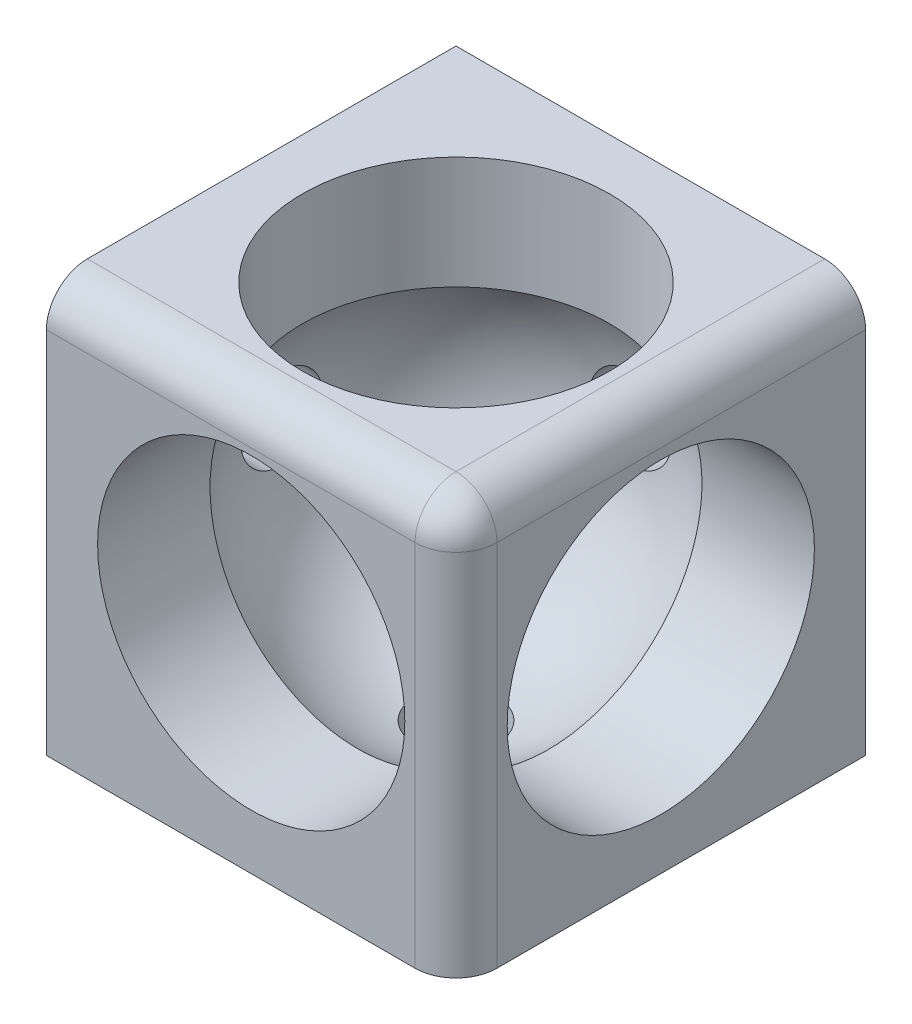
ISO-10303-21;
HEADER;
FILE_DESCRIPTION(('STEP AP214'),'2;1');
FILE_NAME('part.step','',(''),(''),'','','');
FILE_SCHEMA(('AUTOMOTIVE_DESIGN { 1 0 10303 214 1 1 1 1 }'));
ENDSEC;
DATA;
#1=APPLICATION_CONTEXT('core data for automotive mechanical design processes');
#2=APPLICATION_PROTOCOL_DEFINITION('international standard','automotive_design',2000,#1);
#3=PRODUCT_CONTEXT('',#1,'mechanical');
#4=PRODUCT('Part','Part','',(#3));
#5=PRODUCT_RELATED_PRODUCT_CATEGORY('part','',(#4));
#6=PRODUCT_DEFINITION_FORMATION('','',#4);
#7=PRODUCT_DEFINITION_CONTEXT('part definition',#1,'design');
#8=PRODUCT_DEFINITION('design','',#6,#7);
#9=PRODUCT_DEFINITION_SHAPE('','',#8);
#10=(LENGTH_UNIT() NAMED_UNIT(*) SI_UNIT(.MILLI.,.METRE.));
#11=(NAMED_UNIT(*) PLANE_ANGLE_UNIT() SI_UNIT($,.RADIAN.));
#12=(NAMED_UNIT(*) SI_UNIT($,.STERADIAN.) SOLID_ANGLE_UNIT());
#13=UNCERTAINTY_MEASURE_WITH_UNIT(LENGTH_MEASURE(1.E-05),#10,'distance_accuracy_value','');
#14=(GEOMETRIC_REPRESENTATION_CONTEXT(3) GLOBAL_UNCERTAINTY_ASSIGNED_CONTEXT((#13)) GLOBAL_UNIT_ASSIGNED_CONTEXT((#10,
#11,#12)) REPRESENTATION_CONTEXT('',''));
#15=CARTESIAN_POINT('',(0.,0.,0.));
#16=DIRECTION('',(0.,0.,1.));
#17=DIRECTION('',(1.,0.,0.));
#18=AXIS2_PLACEMENT_3D('',#15,#16,#17);
#19=CARTESIAN_POINT('',(-20.,20.,20.));
#20=DIRECTION('',(1.,0.,0.));
#21=DIRECTION('',(0.,0.,-1.));
#22=AXIS2_PLACEMENT_3D('',#19,#20,#21);
#23=PLANE('',#22);
#24=CARTESIAN_POINT('',(-20.,0.,0.));
#25=DIRECTION('',(-1.,0.,0.));
#26=DIRECTION('',(0.,0.,1.));
#27=AXIS2_PLACEMENT_3D('',#24,#25,#26);
#28=CIRCLE('',#27,4.);
#29=CARTESIAN_POINT('',(-20.,0.,4.));
#30=VERTEX_POINT('',#29);
#31=EDGE_CURVE('E388',#30,#30,#28,.T.);
#32=ORIENTED_EDGE('',*,*,#31,.F.);
#33=EDGE_LOOP('',(#32));
#34=FACE_BOUND('',#33,.T.);
#35=DIRECTION('',(0.,-1.,0.));
#36=VECTOR('',#35,1.);
#37=CARTESIAN_POINT('',(-20.,20.,20.));
#38=LINE('',#37,#36);
#39=CARTESIAN_POINT('',(-20.,16.,20.));
#40=VERTEX_POINT('',#39);
#41=CARTESIAN_POINT('',(-20.,-20.,20.));
#42=VERTEX_POINT('',#41);
#43=EDGE_CURVE('E233',#40,#42,#38,.T.);
#44=ORIENTED_EDGE('',*,*,#43,.F.);
#45=CARTESIAN_POINT('',(-20.,16.,16.));
#46=DIRECTION('',(1.,0.,0.));
#47=DIRECTION('',(0.,0.,-1.));
#48=AXIS2_PLACEMENT_3D('',#45,#46,#47);
#49=CIRCLE('',#48,4.);
#50=CARTESIAN_POINT('',(-20.,20.,16.));
#51=VERTEX_POINT('',#50);
#52=EDGE_CURVE('E243',#40,#51,#49,.F.);
#53=ORIENTED_EDGE('',*,*,#52,.T.);
#54=DIRECTION('',(0.,0.,1.));
#55=VECTOR('',#54,1.);
#56=CARTESIAN_POINT('',(-20.,20.,20.));
#57=LINE('',#56,#55);
#58=CARTESIAN_POINT('',(-20.,20.,-20.));
#59=VERTEX_POINT('',#58);
#60=EDGE_CURVE('E228',#59,#51,#57,.T.);
#61=ORIENTED_EDGE('',*,*,#60,.F.);
#62=DIRECTION('',(0.,-1.,0.));
#63=VECTOR('',#62,1.);
#64=CARTESIAN_POINT('',(-20.,20.,-20.));
#65=LINE('',#64,#63);
#66=CARTESIAN_POINT('',(-20.,-20.,-20.));
#67=VERTEX_POINT('',#66);
#68=EDGE_CURVE('E229',#59,#67,#65,.T.);
#69=ORIENTED_EDGE('',*,*,#68,.T.);
#70=DIRECTION('',(0.,0.,1.));
#71=VECTOR('',#70,1.);
#72=CARTESIAN_POINT('',(-20.,-20.,20.));
#73=LINE('',#72,#71);
#74=EDGE_CURVE('E208',#67,#42,#73,.T.);
#75=ORIENTED_EDGE('',*,*,#74,.T.);
#76=EDGE_LOOP('',(#44,#53,#61,#69,#75));
#77=FACE_BOUND('',#76,.T.);
#78=ADVANCED_FACE('F34',(#34,#77),#23,.F.);
#79=CARTESIAN_POINT('',(20.,20.,20.));
#80=DIRECTION('',(0.,0.,-1.));
#81=DIRECTION('',(-1.,0.,0.));
#82=AXIS2_PLACEMENT_3D('',#79,#80,#81);
#83=PLANE('',#82);
#84=CARTESIAN_POINT('',(0.,0.367598837078294,20.));
#85=DIRECTION('',(0.,0.,1.));
#86=DIRECTION('',(1.,0.,0.));
#87=AXIS2_PLACEMENT_3D('',#84,#85,#86);
#88=CIRCLE('',#87,15.);
#89=CARTESIAN_POINT('',(15.,0.367598837078294,20.));
#90=VERTEX_POINT('',#89);
#91=EDGE_CURVE('E108',#90,#90,#88,.T.);
#92=ORIENTED_EDGE('',*,*,#91,.F.);
#93=EDGE_LOOP('',(#92));
#94=FACE_BOUND('',#93,.T.);
#95=DIRECTION('',(0.,-1.,0.));
#96=VECTOR('',#95,1.);
#97=CARTESIAN_POINT('',(16.,20.,20.));
#98=LINE('',#97,#96);
#99=CARTESIAN_POINT('',(16.,-20.,20.));
#100=VERTEX_POINT('',#99);
#101=CARTESIAN_POINT('',(16.,16.,20.));
#102=VERTEX_POINT('',#101);
#103=EDGE_CURVE('E192',#100,#102,#98,.F.);
#104=ORIENTED_EDGE('',*,*,#103,.T.);
#105=DIRECTION('',(1.,0.,0.));
#106=VECTOR('',#105,1.);
#107=CARTESIAN_POINT('',(-20.,16.,20.));
#108=LINE('',#107,#106);
#109=EDGE_CURVE('E241',#102,#40,#108,.F.);
#110=ORIENTED_EDGE('',*,*,#109,.T.);
#111=ORIENTED_EDGE('',*,*,#43,.T.);
#112=DIRECTION('',(1.,0.,0.));
#113=VECTOR('',#112,1.);
#114=CARTESIAN_POINT('',(20.,-20.,20.));
#115=LINE('',#114,#113);
#116=EDGE_CURVE('E212',#42,#100,#115,.T.);
#117=ORIENTED_EDGE('',*,*,#116,.T.);
#118=EDGE_LOOP('',(#104,#110,#111,#117));
#119=FACE_BOUND('',#118,.T.);
#120=ADVANCED_FACE('F164',(#94,#119),#83,.F.);
#121=CARTESIAN_POINT('',(20.,20.,20.));
#122=DIRECTION('',(-1.,0.,0.));
#123=DIRECTION('',(0.,0.,1.));
#124=AXIS2_PLACEMENT_3D('',#121,#122,#123);
#125=PLANE('',#124);
#126=CARTESIAN_POINT('',(20.,0.,0.));
#127=DIRECTION('',(1.,0.,0.));
#128=DIRECTION('',(0.,0.,-1.));
#129=AXIS2_PLACEMENT_3D('',#126,#127,#128);
#130=CIRCLE('',#129,15.);
#131=CARTESIAN_POINT('',(20.,0.,-15.));
#132=VERTEX_POINT('',#131);
#133=EDGE_CURVE('E261',#132,#132,#130,.T.);
#134=ORIENTED_EDGE('',*,*,#133,.F.);
#135=EDGE_LOOP('',(#134));
#136=FACE_BOUND('',#135,.T.);
#137=DIRECTION('',(0.,0.,-1.));
#138=VECTOR('',#137,1.);
#139=CARTESIAN_POINT('',(20.,16.,20.));
#140=LINE('',#139,#138);
#141=CARTESIAN_POINT('',(20.,16.,-20.));
#142=VERTEX_POINT('',#141);
#143=CARTESIAN_POINT('',(20.,16.,16.));
#144=VERTEX_POINT('',#143);
#145=EDGE_CURVE('E198',#142,#144,#140,.F.);
#146=ORIENTED_EDGE('',*,*,#145,.T.);
#147=DIRECTION('',(0.,-1.,0.));
#148=VECTOR('',#147,1.);
#149=CARTESIAN_POINT('',(20.,20.,16.));
#150=LINE('',#149,#148);
#151=CARTESIAN_POINT('',(20.,-20.,16.));
#152=VERTEX_POINT('',#151);
#153=EDGE_CURVE('E190',#144,#152,#150,.T.);
#154=ORIENTED_EDGE('',*,*,#153,.T.);
#155=DIRECTION('',(0.,0.,-1.));
#156=VECTOR('',#155,1.);
#157=CARTESIAN_POINT('',(20.,-20.,20.));
#158=LINE('',#157,#156);
#159=CARTESIAN_POINT('',(20.,-20.,-20.));
#160=VERTEX_POINT('',#159);
#161=EDGE_CURVE('E218',#152,#160,#158,.T.);
#162=ORIENTED_EDGE('',*,*,#161,.T.);
#163=DIRECTION('',(0.,-1.,0.));
#164=VECTOR('',#163,1.);
#165=CARTESIAN_POINT('',(20.,20.,-20.));
#166=LINE('',#165,#164);
#167=EDGE_CURVE('E231',#142,#160,#166,.T.);
#168=ORIENTED_EDGE('',*,*,#167,.F.);
#169=EDGE_LOOP('',(#146,#154,#162,#168));
#170=FACE_BOUND('',#169,.T.);
#171=ADVANCED_FACE('F160',(#136,#170),#125,.F.);
#172=CARTESIAN_POINT('',(20.,20.,-20.));
#173=DIRECTION('',(0.,0.,1.));
#174=DIRECTION('',(1.,0.,0.));
#175=AXIS2_PLACEMENT_3D('',#172,#173,#174);
#176=PLANE('',#175);
#177=CARTESIAN_POINT('',(0.,0.,-20.));
#178=DIRECTION('',(0.,0.,-1.));
#179=DIRECTION('',(-1.,0.,0.));
#180=AXIS2_PLACEMENT_3D('',#177,#178,#179);
#181=CIRCLE('',#180,4.);
#182=CARTESIAN_POINT('',(-4.,0.,-20.));
#183=VERTEX_POINT('',#182);
#184=EDGE_CURVE('E396',#183,#183,#181,.T.);
#185=ORIENTED_EDGE('',*,*,#184,.F.);
#186=EDGE_LOOP('',(#185));
#187=FACE_BOUND('',#186,.T.);
#188=DIRECTION('',(-1.,0.,0.));
#189=VECTOR('',#188,1.);
#190=CARTESIAN_POINT('',(20.,20.,-20.));
#191=LINE('',#190,#189);
#192=CARTESIAN_POINT('',(16.,20.,-20.));
#193=VERTEX_POINT('',#192);
#194=EDGE_CURVE('E221',#193,#59,#191,.T.);
#195=ORIENTED_EDGE('',*,*,#194,.F.);
#196=CARTESIAN_POINT('',(16.,16.,-20.));
#197=DIRECTION('',(0.,0.,1.));
#198=DIRECTION('',(1.,0.,0.));
#199=AXIS2_PLACEMENT_3D('',#196,#197,#198);
#200=CIRCLE('',#199,4.);
#201=EDGE_CURVE('E112',#193,#142,#200,.F.);
#202=ORIENTED_EDGE('',*,*,#201,.T.);
#203=ORIENTED_EDGE('',*,*,#167,.T.);
#204=DIRECTION('',(-1.,0.,0.));
#205=VECTOR('',#204,1.);
#206=CARTESIAN_POINT('',(20.,-20.,-20.));
#207=LINE('',#206,#205);
#208=EDGE_CURVE('E226',#160,#67,#207,.T.);
#209=ORIENTED_EDGE('',*,*,#208,.T.);
#210=ORIENTED_EDGE('',*,*,#68,.F.);
#211=EDGE_LOOP('',(#195,#202,#203,#209,#210));
#212=FACE_BOUND('',#211,.T.);
#213=ADVANCED_FACE('F153',(#187,#212),#176,.F.);
#214=CARTESIAN_POINT('',(0.,20.,0.));
#215=DIRECTION('',(0.,1.,0.));
#216=DIRECTION('',(0.,0.,1.));
#217=AXIS2_PLACEMENT_3D('',#214,#215,#216);
#218=PLANE('',#217);
#219=CARTESIAN_POINT('',(0.,20.,0.));
#220=DIRECTION('',(0.,1.,0.));
#221=DIRECTION('',(0.,0.,1.));
#222=AXIS2_PLACEMENT_3D('',#219,#220,#221);
#223=CIRCLE('',#222,15.);
#224=CARTESIAN_POINT('',(0.,20.,15.));
#225=VERTEX_POINT('',#224);
#226=EDGE_CURVE('E258',#225,#225,#223,.T.);
#227=ORIENTED_EDGE('',*,*,#226,.F.);
#228=EDGE_LOOP('',(#227));
#229=FACE_BOUND('',#228,.T.);
#230=ORIENTED_EDGE('',*,*,#60,.T.);
#231=DIRECTION('',(1.,0.,0.));
#232=VECTOR('',#231,1.);
#233=CARTESIAN_POINT('',(20.,20.,16.));
#234=LINE('',#233,#232);
#235=CARTESIAN_POINT('',(16.,20.,16.));
#236=VERTEX_POINT('',#235);
#237=EDGE_CURVE('E237',#51,#236,#234,.T.);
#238=ORIENTED_EDGE('',*,*,#237,.T.);
#239=DIRECTION('',(0.,0.,-1.));
#240=VECTOR('',#239,1.);
#241=CARTESIAN_POINT('',(16.,20.,-20.));
#242=LINE('',#241,#240);
#243=EDGE_CURVE('E235',#236,#193,#242,.T.);
#244=ORIENTED_EDGE('',*,*,#243,.T.);
#245=ORIENTED_EDGE('',*,*,#194,.T.);
#246=EDGE_LOOP('',(#230,#238,#244,#245));
#247=FACE_BOUND('',#246,.T.);
#248=ADVANCED_FACE('F149',(#229,#247),#218,.T.);
#249=CARTESIAN_POINT('',(0.,-20.,0.));
#250=DIRECTION('',(0.,1.,0.));
#251=DIRECTION('',(0.,0.,1.));
#252=AXIS2_PLACEMENT_3D('',#249,#250,#251);
#253=PLANE('',#252);
#254=CARTESIAN_POINT('',(0.,-20.,0.));
#255=DIRECTION('',(0.,-1.,0.));
#256=DIRECTION('',(0.,0.,-1.));
#257=AXIS2_PLACEMENT_3D('',#254,#255,#256);
#258=CIRCLE('',#257,4.);
#259=CARTESIAN_POINT('',(0.,-20.,-4.));
#260=VERTEX_POINT('',#259);
#261=EDGE_CURVE('E391',#260,#260,#258,.T.);
#262=ORIENTED_EDGE('',*,*,#261,.F.);
#263=EDGE_LOOP('',(#262));
#264=FACE_BOUND('',#263,.T.);
#265=ORIENTED_EDGE('',*,*,#161,.F.);
#266=CARTESIAN_POINT('',(16.,-20.,16.));
#267=DIRECTION('',(0.,1.,0.));
#268=DIRECTION('',(0.,0.,1.));
#269=AXIS2_PLACEMENT_3D('',#266,#267,#268);
#270=CIRCLE('',#269,4.);
#271=EDGE_CURVE('E114',#152,#100,#270,.F.);
#272=ORIENTED_EDGE('',*,*,#271,.T.);
#273=ORIENTED_EDGE('',*,*,#116,.F.);
#274=ORIENTED_EDGE('',*,*,#74,.F.);
#275=ORIENTED_EDGE('',*,*,#208,.F.);
#276=EDGE_LOOP('',(#265,#272,#273,#274,#275));
#277=FACE_BOUND('',#276,.T.);
#278=ADVANCED_FACE('F152',(#264,#277),#253,.F.);
#279=CARTESIAN_POINT('',(16.,16.,0.));
#280=DIRECTION('',(0.,0.,1.));
#281=DIRECTION('',(1.,0.,0.));
#282=AXIS2_PLACEMENT_3D('',#279,#280,#281);
#283=CYLINDRICAL_SURFACE('',#282,4.);
#284=ORIENTED_EDGE('',*,*,#201,.F.);
#285=ORIENTED_EDGE('',*,*,#243,.F.);
#286=CARTESIAN_POINT('',(16.,16.,16.));
#287=DIRECTION('',(0.,0.,1.));
#288=DIRECTION('',(1.,0.,0.));
#289=AXIS2_PLACEMENT_3D('',#286,#287,#288);
#290=CIRCLE('',#289,4.);
#291=EDGE_CURVE('E206',#144,#236,#290,.T.);
#292=ORIENTED_EDGE('',*,*,#291,.F.);
#293=ORIENTED_EDGE('',*,*,#145,.F.);
#294=EDGE_LOOP('',(#284,#285,#292,#293));
#295=FACE_BOUND('',#294,.T.);
#296=ADVANCED_FACE('F36',(#295),#283,.T.);
#297=CARTESIAN_POINT('',(16.,20.,16.));
#298=DIRECTION('',(0.,-1.,0.));
#299=DIRECTION('',(0.,0.,-1.));
#300=AXIS2_PLACEMENT_3D('',#297,#298,#299);
#301=CYLINDRICAL_SURFACE('',#300,4.);
#302=ORIENTED_EDGE('',*,*,#271,.F.);
#303=ORIENTED_EDGE('',*,*,#153,.F.);
#304=CARTESIAN_POINT('',(16.,16.,16.));
#305=DIRECTION('',(0.,1.,0.));
#306=DIRECTION('',(0.,0.,1.));
#307=AXIS2_PLACEMENT_3D('',#304,#305,#306);
#308=CIRCLE('',#307,4.);
#309=EDGE_CURVE('E204',#102,#144,#308,.T.);
#310=ORIENTED_EDGE('',*,*,#309,.F.);
#311=ORIENTED_EDGE('',*,*,#103,.F.);
#312=EDGE_LOOP('',(#302,#303,#310,#311));
#313=FACE_BOUND('',#312,.T.);
#314=ADVANCED_FACE('F178',(#313),#301,.T.);
#315=CARTESIAN_POINT('',(16.,16.,16.));
#316=DIRECTION('',(1.,0.,0.));
#317=DIRECTION('',(0.,0.,-1.));
#318=AXIS2_PLACEMENT_3D('',#315,#316,#317);
#319=SPHERICAL_SURFACE('',#318,4.);
#320=ORIENTED_EDGE('',*,*,#309,.T.);
#321=ORIENTED_EDGE('',*,*,#291,.T.);
#322=CARTESIAN_POINT('',(16.,16.,16.));
#323=DIRECTION('',(1.,0.,0.));
#324=DIRECTION('',(0.,0.,-1.));
#325=AXIS2_PLACEMENT_3D('',#322,#323,#324);
#326=CIRCLE('',#325,4.);
#327=EDGE_CURVE('E202',#102,#236,#326,.F.);
#328=ORIENTED_EDGE('',*,*,#327,.F.);
#329=EDGE_LOOP('',(#320,#321,#328));
#330=FACE_BOUND('',#329,.T.);
#331=ADVANCED_FACE('F175',(#330),#319,.T.);
#332=CARTESIAN_POINT('',(0.,16.,16.));
#333=DIRECTION('',(-1.,0.,0.));
#334=DIRECTION('',(0.,0.,1.));
#335=AXIS2_PLACEMENT_3D('',#332,#333,#334);
#336=CYLINDRICAL_SURFACE('',#335,4.);
#337=ORIENTED_EDGE('',*,*,#52,.F.);
#338=ORIENTED_EDGE('',*,*,#109,.F.);
#339=ORIENTED_EDGE('',*,*,#327,.T.);
#340=ORIENTED_EDGE('',*,*,#237,.F.);
#341=EDGE_LOOP('',(#337,#338,#339,#340));
#342=FACE_BOUND('',#341,.T.);
#343=ADVANCED_FACE('F172',(#342),#336,.T.);
#344=CARTESIAN_POINT('',(0.,0.,0.));
#345=DIRECTION('',(0.,1.,0.));
#346=DIRECTION('',(0.,0.,1.));
#347=AXIS2_PLACEMENT_3D('',#344,#345,#346);
#348=CYLINDRICAL_SURFACE('',#347,15.);
#349=ORIENTED_EDGE('',*,*,#226,.T.);
#350=EDGE_LOOP('',(#349));
#351=FACE_BOUND('',#350,.T.);
#352=CARTESIAN_POINT('',(0.,0.,0.));
#353=DIRECTION('',(-0.707106781186547,0.707106781186547,0.));
#354=DIRECTION('',(0.707106781186547,0.707106781186547,0.));
#355=AXIS2_PLACEMENT_3D('',#352,#353,#354);
#356=ELLIPSE('',#355,21.2132034355964,15.);
#357=CARTESIAN_POINT('',(9.01387818865998,9.01387818865998,-11.9895788082818));
#358=VERTEX_POINT('',#357);
#359=CARTESIAN_POINT('',(10.7888085073492,10.7888085073492,10.4212096702709));
#360=VERTEX_POINT('',#359);
#361=EDGE_CURVE('E111',#358,#360,#356,.F.);
#362=ORIENTED_EDGE('',*,*,#361,.T.);
#363=CARTESIAN_POINT('',(0.,0.367598837078294,0.));
#364=DIRECTION('',(0.,0.707106781186547,-0.707106781186547));
#365=DIRECTION('',(0.,0.707106781186547,0.707106781186547));
#366=AXIS2_PLACEMENT_3D('',#363,#364,#365);
#367=ELLIPSE('',#366,21.2132034355964,15.);
#368=CARTESIAN_POINT('',(-12.2573183598376,9.01387818865998,8.64627935158168));
#369=VERTEX_POINT('',#368);
#370=EDGE_CURVE('E51',#360,#369,#367,.F.);
#371=ORIENTED_EDGE('',*,*,#370,.T.);
#372=CARTESIAN_POINT('',(0.,9.01387818865998,0.));
#373=DIRECTION('',(0.,-1.,0.));
#374=DIRECTION('',(0.,0.,-1.));
#375=AXIS2_PLACEMENT_3D('',#372,#373,#374);
#376=CIRCLE('',#375,15.);
#377=EDGE_CURVE('E107',#358,#369,#376,.F.);
#378=ORIENTED_EDGE('',*,*,#377,.F.);
#379=EDGE_LOOP('',(#362,#371,#378));
#380=FACE_BOUND('',#379,.T.);
#381=ADVANCED_FACE('F147',(#351,#380),#348,.F.);
#382=CARTESIAN_POINT('',(0.,0.,0.));
#383=DIRECTION('',(0.,0.,-1.));
#384=DIRECTION('',(1.,0.,0.));
#385=AXIS2_PLACEMENT_3D('',#382,#383,#384);
#386=SPHERICAL_SURFACE('',#385,17.5);
#387=CARTESIAN_POINT('',(-17.0367250374008,0.,0.));
#388=DIRECTION('',(1.,0.,0.));
#389=DIRECTION('',(0.,0.,-1.));
#390=AXIS2_PLACEMENT_3D('',#387,#388,#389);
#391=CIRCLE('',#390,4.);
#392=CARTESIAN_POINT('',(-17.0367250374008,0.,-4.));
#393=VERTEX_POINT('',#392);
#394=EDGE_CURVE('E38',#393,#393,#391,.F.);
#395=ORIENTED_EDGE('',*,*,#394,.T.);
#396=EDGE_LOOP('',(#395));
#397=FACE_BOUND('',#396,.T.);
#398=CARTESIAN_POINT('',(0.,-17.0367250374008,0.));
#399=DIRECTION('',(0.,1.,0.));
#400=DIRECTION('',(0.,0.,1.));
#401=AXIS2_PLACEMENT_3D('',#398,#399,#400);
#402=CIRCLE('',#401,4.);
#403=CARTESIAN_POINT('',(0.,-17.0367250374008,4.));
#404=VERTEX_POINT('',#403);
#405=EDGE_CURVE('E393',#404,#404,#402,.F.);
#406=ORIENTED_EDGE('',*,*,#405,.T.);
#407=EDGE_LOOP('',(#406));
#408=FACE_BOUND('',#407,.T.);
#409=CARTESIAN_POINT('',(0.,0.,-17.0367250374008));
#410=DIRECTION('',(0.,0.,1.));
#411=DIRECTION('',(1.,0.,0.));
#412=AXIS2_PLACEMENT_3D('',#409,#410,#411);
#413=CIRCLE('',#412,4.);
#414=CARTESIAN_POINT('',(4.,0.,-17.0367250374008));
#415=VERTEX_POINT('',#414);
#416=EDGE_CURVE('E125',#415,#415,#413,.F.);
#417=ORIENTED_EDGE('',*,*,#416,.T.);
#418=EDGE_LOOP('',(#417));
#419=FACE_BOUND('',#418,.T.);
#420=ORIENTED_EDGE('',*,*,#377,.T.);
#421=CARTESIAN_POINT('',(-12.2571772779328,9.01407818865998,8.64627084852498));
#422=CARTESIAN_POINT('',(-12.5005987998844,8.66908440066232,8.66093874403026));
#423=CARTESIAN_POINT('',(-12.7293681341578,8.31378038972261,8.67600692202149));
#424=CARTESIAN_POINT('',(-13.1561412104533,7.58520328950414,8.70682150361769));
#425=CARTESIAN_POINT('',(-13.3541465120881,7.21193111239654,8.72256787278938));
#426=CARTESIAN_POINT('',(-13.7178255686971,6.45030518660715,8.75460658185257));
#427=CARTESIAN_POINT('',(-13.8835222794302,6.06196238280722,8.77089852439059));
#428=CARTESIAN_POINT('',(-14.1815980614158,5.27271736616978,8.80391456873411));
#429=CARTESIAN_POINT('',(-14.3139775087584,4.87181529516051,8.82063866565904));
#430=CARTESIAN_POINT('',(-14.5445338918902,4.06010854142793,8.85440182536596));
#431=CARTESIAN_POINT('',(-14.6426951790959,3.6492994196095,8.87144102851061));
#432=CARTESIAN_POINT('',(-14.8040369105046,2.82087595662124,8.90570159500348));
#433=CARTESIAN_POINT('',(-14.867217345018,2.40326161356641,8.92292295840217));
#434=CARTESIAN_POINT('',(-14.9581407637449,1.56427479441476,8.95742011832697));
#435=CARTESIAN_POINT('',(-14.9858904163263,1.14290304053141,8.97469590399661));
#436=CARTESIAN_POINT('',(-15.0057770316755,0.299319165359619,9.0091823984931));
#437=CARTESIAN_POINT('',(-14.9979141478689,-0.122892952300537,9.02639310759998));
#438=CARTESIAN_POINT('',(-14.9466235748119,-0.965274555862291,9.06063406831588));
#439=CARTESIAN_POINT('',(-14.9031861997454,-1.38544345411501,9.07766426949897));
#440=CARTESIAN_POINT('',(-14.7810404681427,-2.22063600287756,9.11142251572028));
#441=CARTESIAN_POINT('',(-14.7023320430701,-2.63565964338787,9.12815056017129));
#442=CARTESIAN_POINT('',(-14.5101860357686,-3.45767015896315,9.1611938635037));
#443=CARTESIAN_POINT('',(-14.3967432996983,-3.8646558318166,9.17750906073803));
#444=CARTESIAN_POINT('',(-14.1359353619342,-4.66762988446372,9.20961547924528));
#445=CARTESIAN_POINT('',(-13.9885701829924,-5.06361827163317,9.22540670086962));
#446=CARTESIAN_POINT('',(-13.660997896142,-5.84169027371586,9.25635811142833));
#447=CARTESIAN_POINT('',(-13.4807981941746,-6.22377700092947,9.27151844171715));
#448=CARTESIAN_POINT('',(-13.0888113997481,-6.97141821336225,9.30111382418194));
#449=CARTESIAN_POINT('',(-12.8770243063739,-7.33697269810249,9.31554887633692));
#450=CARTESIAN_POINT('',(-12.4233784486216,-8.04892203600185,9.34360072022146));
#451=CARTESIAN_POINT('',(-12.1815215283409,-8.39531806221444,9.35721756205366));
#452=CARTESIAN_POINT('',(-11.6694421127722,-9.06650416773141,9.38354810536651));
#453=CARTESIAN_POINT('',(-11.3992196327409,-9.39129425865661,9.39626180733292));
#454=CARTESIAN_POINT('',(-10.8324929593542,-10.0167688578921,9.42069972598702));
#455=CARTESIAN_POINT('',(-10.5360041139015,-10.3174672503204,9.43242451279793));
#456=CARTESIAN_POINT('',(-9.91871579831311,-10.892822842097,9.45482058831269));
#457=CARTESIAN_POINT('',(-9.59791633478036,-11.1674800485183,9.46549187730266));
#458=CARTESIAN_POINT('',(-8.93428060798896,-11.6887969339561,9.485715972723));
#459=CARTESIAN_POINT('',(-8.59144396893506,-11.93545613533,9.49526876007196));
#460=CARTESIAN_POINT('',(-7.88617688189099,-12.3990093533168,9.51319778721689));
#461=CARTESIAN_POINT('',(-7.52374644438373,-12.6159033858541,9.52157402764232));
#462=CARTESIAN_POINT('',(-6.78214471001878,-13.0182273041125,9.53709387293941));
#463=CARTESIAN_POINT('',(-6.40298595853409,-13.203680280027,9.54423838245536));
#464=CARTESIAN_POINT('',(-5.63037465800189,-13.5419923426684,9.55725968008102));
#465=CARTESIAN_POINT('',(-5.23692211118803,-13.6948514344887,9.56313646838883));
#466=CARTESIAN_POINT('',(-4.43853917240782,-13.9668776432049,9.57358721625019));
#467=CARTESIAN_POINT('',(-4.03360926636109,-14.0860461841282,9.57816123086926));
#468=CARTESIAN_POINT('',(-3.21513801618383,-14.2898478909746,9.58597971709774));
#469=CARTESIAN_POINT('',(-2.80159668886723,-14.3744811243219,9.58922419130285));
#470=CARTESIAN_POINT('',(-1.96914019959147,-14.5085600017858,9.59436267187399));
#471=CARTESIAN_POINT('',(-1.5502290392239,-14.5580304552232,9.59625763040116));
#472=CARTESIAN_POINT('',(-0.70972245779904,-14.621527748466,9.5986896805324));
#473=CARTESIAN_POINT('',(-0.288127020207144,-14.6355543697324,9.59922676376412));
#474=CARTESIAN_POINT('',(0.554856703563285,-14.6280621874766,9.59893984910684));
#475=CARTESIAN_POINT('',(0.976244907807999,-14.6065341767017,9.59811549866002));
#476=CARTESIAN_POINT('',(1.81569545069976,-14.5280701075525,9.59510992690288));
#477=CARTESIAN_POINT('',(2.23375787868091,-14.4711350035273,9.59292874216415));
#478=CARTESIAN_POINT('',(3.06371833155656,-14.3222423949254,9.58722151295639));
#479=CARTESIAN_POINT('',(3.47561447424194,-14.2302744145915,9.58369506621796));
#480=CARTESIAN_POINT('',(4.29018385719823,-14.0119739042208,9.57531811785321));
#481=CARTESIAN_POINT('',(4.69285712949279,-13.8856414935238,9.570467620825));
#482=CARTESIAN_POINT('',(5.4856901587069,-13.5996706660852,9.55947725015097));
#483=CARTESIAN_POINT('',(5.87586271862032,-13.4400676700632,9.55333874770362));
#484=CARTESIAN_POINT('',(6.64123236698416,-13.0886729382665,9.53980799173098));
#485=CARTESIAN_POINT('',(7.0164358964665,-12.8968952359699,9.53241628479474));
#486=CARTESIAN_POINT('',(7.66620600518526,-12.5295035284626,9.51823665347175));
#487=CARTESIAN_POINT('',(7.94430155223004,-12.3600839079076,9.51169183695729));
#488=CARTESIAN_POINT('',(8.48839074775826,-12.0038543353243,9.49791460506178));
#489=CARTESIAN_POINT('',(8.75440521145859,-11.817076125915,9.49068344426154));
#490=CARTESIAN_POINT('',(9.01407818865997,-11.6218296067102,9.48311504735226));
#491=B_SPLINE_CURVE_WITH_KNOTS('',3,(#421,#422,#423,#424,#425,#426,#427,#428,#429,#430,#431,
#432,#433,#434,#435,#436,#437,#438,#439,#440,#441,#442,#443,#444,#445,#446,#447,#448,#449,#450,
#451,#452,#453,#454,#455,#456,#457,#458,#459,#460,#461,#462,#463,#464,#465,#466,#467,#468,#469,
#470,#471,#472,#473,#474,#475,#476,#477,#478,#479,#480,#481,#482,#483,#484,#485,#486,#487,#488,
#489,#490),.UNSPECIFIED.,.F.,.F.,(4,2,2,2,2,2,2,2,2,2,2,2,2,2,2,2,2,2,2,2,2,2,2,2,2,2,2,2,2,2,2,
2,2,2,4),(0.,1.26705386772424,2.53404347994242,3.80012956941541,5.06620136648762,
6.33285140383622,7.59950179204758,8.86591375095936,10.1323202539239,11.3990716742564,
12.6658255560667,13.9327674886754,15.1997085715349,16.4663642443562,17.7330199538708,
18.9995980212534,20.266175407397,21.5320175306847,22.7978593101626,24.0637226815005,
25.3295853755937,26.5945143595809,27.8594431459027,29.1243184583998,30.3891913014419,
31.6531708172166,32.9171581263974,34.181472809952,35.4457534171335,36.7104123748286,
37.9750669407102,39.2383819368208,40.5011473449692,41.4775959535608,42.4522928622778),.UNSPECIFIED.);
#492=CARTESIAN_POINT('',(9.01387818865998,-11.6219799712035,9.4831208760062));
#493=VERTEX_POINT('',#492);
#494=EDGE_CURVE('E102',#369,#493,#491,.T.);
#495=ORIENTED_EDGE('',*,*,#494,.T.);
#496=CARTESIAN_POINT('',(9.01387818865998,0.,0.));
#497=DIRECTION('',(-1.,0.,0.));
#498=DIRECTION('',(0.,0.,1.));
#499=AXIS2_PLACEMENT_3D('',#496,#497,#498);
#500=CIRCLE('',#499,15.);
#501=EDGE_CURVE('E43',#493,#358,#500,.F.);
#502=ORIENTED_EDGE('',*,*,#501,.T.);
#503=EDGE_LOOP('',(#420,#495,#502));
#504=FACE_BOUND('',#503,.T.);
#505=ADVANCED_FACE('F105',(#397,#408,#419,#504),#386,.F.);
#506=CARTESIAN_POINT('',(0.,0.,0.));
#507=DIRECTION('',(1.,0.,0.));
#508=DIRECTION('',(0.,0.,-1.));
#509=AXIS2_PLACEMENT_3D('',#506,#507,#508);
#510=CYLINDRICAL_SURFACE('',#509,15.);
#511=ORIENTED_EDGE('',*,*,#133,.T.);
#512=EDGE_LOOP('',(#511));
#513=FACE_BOUND('',#512,.T.);
#514=ORIENTED_EDGE('',*,*,#501,.F.);
#515=CARTESIAN_POINT('',(9.01387818865998,-11.6219799712035,9.4831208760062));
#516=CARTESIAN_POINT('',(9.17162939903245,-11.5033750121779,9.62847312748471));
#517=CARTESIAN_POINT('',(9.32770573103259,-11.3811680057776,9.77267916571143));
#518=CARTESIAN_POINT('',(9.63632627974576,-11.1293971576968,10.0584694653407));
#519=CARTESIAN_POINT('',(9.78887009008371,-10.9998324754628,10.2000534247324));
#520=CARTESIAN_POINT('',(10.2413693030814,-10.5994778006351,10.6207875982365));
#521=CARTESIAN_POINT('',(10.5356740777269,-10.3174149933982,10.8954413882354));
#522=CARTESIAN_POINT('',(11.1096817993972,-9.71945001735921,11.4322109531378));
#523=CARTESIAN_POINT('',(11.3891989930265,-9.403223650008,11.6941648096615));
#524=CARTESIAN_POINT('',(11.9269548641702,-8.7389982440658,12.1985073931021));
#525=CARTESIAN_POINT('',(12.1852096597037,-8.39102370210024,12.44091093729));
#526=CARTESIAN_POINT('',(12.6137675461017,-7.75641375465158,12.8429262352815));
#527=CARTESIAN_POINT('',(12.7896566682181,-7.47689257356833,13.0078422182435));
#528=CARTESIAN_POINT('',(13.12577374915,-6.90050272331957,13.32256804257));
#529=CARTESIAN_POINT('',(13.2860057603004,-6.60363857477093,13.4723817929764));
#530=CARTESIAN_POINT('',(13.588293604088,-5.99428173771555,13.7543037446309));
#531=CARTESIAN_POINT('',(13.7304137823748,-5.68185019204225,13.8864747093437));
#532=CARTESIAN_POINT('',(13.9950575783289,-5.04149645010055,14.1315522878203));
#533=CARTESIAN_POINT('',(14.1175844441744,-4.71357683314387,14.2444620949052));
#534=CARTESIAN_POINT('',(14.3243436393928,-4.09373408918155,14.433647553038));
#535=CARTESIAN_POINT('',(14.4115609608109,-3.80370486859078,14.5128738636879));
#536=CARTESIAN_POINT('',(14.5690547771872,-3.21505847420668,14.654521651574));
#537=CARTESIAN_POINT('',(14.6393328025478,-2.91644207896316,14.7169446469868));
#538=CARTESIAN_POINT('',(14.76188290806,-2.31229474850929,14.8238798369429));
#539=CARTESIAN_POINT('',(14.8141511214916,-2.00676234341378,14.8683881855427));
#540=CARTESIAN_POINT('',(14.8998090451919,-1.39090475309892,14.9385884860559));
#541=CARTESIAN_POINT('',(14.9331985543707,-1.08057951686401,14.9642802375418));
#542=CARTESIAN_POINT('',(14.9806113624669,-0.4566613345345,14.9963087278735));
#543=CARTESIAN_POINT('',(14.9945856247741,-0.14306212260624,15.0025965072669));
#544=CARTESIAN_POINT('',(15.0028258381431,0.484171577653027,14.9954641690448));
#545=CARTESIAN_POINT('',(14.997091770805,0.797806066016695,14.98204403303));
#546=CARTESIAN_POINT('',(14.9661187470735,1.42265774157251,14.9356687888257));
#547=CARTESIAN_POINT('',(14.9408791927314,1.73387485436359,14.9027130817724));
#548=CARTESIAN_POINT('',(14.8714664786299,2.35155349414662,14.8178063485681));
#549=CARTESIAN_POINT('',(14.8272934139556,2.65801504501322,14.7658554178123));
#550=CARTESIAN_POINT('',(14.7230376300364,3.25193725406731,14.6462613964269));
#551=CARTESIAN_POINT('',(14.6636634564469,3.53966718717422,14.5793306271514));
#552=CARTESIAN_POINT('',(14.5292868605296,4.1072344585099,14.4297178788008));
#553=CARTESIAN_POINT('',(14.4542852745288,4.38707221819195,14.347036742653));
#554=CARTESIAN_POINT('',(14.2897813992524,4.93757427893962,14.1670118600145));
#555=CARTESIAN_POINT('',(14.2002800512274,5.20823917408265,14.0696690653126));
#556=CARTESIAN_POINT('',(14.007958075932,5.73946562501851,13.8614562189904));
#557=CARTESIAN_POINT('',(13.9051347404203,6.00002511243914,13.7505834171073));
#558=CARTESIAN_POINT('',(13.6437987023854,6.61240082708717,13.4696166760223));
#559=CARTESIAN_POINT('',(13.4794628171367,6.95902656975455,13.2935748514687));
#560=CARTESIAN_POINT('',(13.1302493507543,7.62980667142491,12.920275395033));
#561=CARTESIAN_POINT('',(12.9453642357957,7.95395271765008,12.7230099829446));
#562=CARTESIAN_POINT('',(12.5574528832449,8.58017911077875,12.3094187080293));
#563=CARTESIAN_POINT('',(12.3543697845784,8.88218452684837,12.0930331342459));
#564=CARTESIAN_POINT('',(11.9333413937505,9.46287077640876,11.6442570632129));
#565=CARTESIAN_POINT('',(11.7153984858901,9.74155533589264,11.41186913353));
#566=CARTESIAN_POINT('',(11.2986473094295,10.2382807101264,10.9668864230849));
#567=CARTESIAN_POINT('',(11.1014658470613,10.4593352063639,10.756112123883));
#568=CARTESIAN_POINT('',(10.6992951550721,10.8847639361158,10.3253828846653));
#569=CARTESIAN_POINT('',(10.4943057310012,11.0891377538148,10.1054277159957));
#570=CARTESIAN_POINT('',(10.0796068402374,11.479844003743,9.65921414868217));
#571=CARTESIAN_POINT('',(9.86995301867471,11.6663162855985,9.43302609327699));
#572=CARTESIAN_POINT('',(9.44549863064955,12.0234741237218,8.97332689948499));
#573=CARTESIAN_POINT('',(9.23069993378133,12.1941653082984,8.73981841201883));
#574=CARTESIAN_POINT('',(9.01387818865998,12.3571776453601,8.5029501139906));
#575=B_SPLINE_CURVE_WITH_KNOTS('',3,(#515,#516,#517,#518,#519,#520,#521,#522,#523,#524,#525,
#526,#527,#528,#529,#530,#531,#532,#533,#534,#535,#536,#537,#538,#539,#540,#541,#542,#543,#544,
#545,#546,#547,#548,#549,#550,#551,#552,#553,#554,#555,#556,#557,#558,#559,#560,#561,#562,#563,
#564,#565,#566,#567,#568,#569,#570,#571,#572,#573,#574),.UNSPECIFIED.,.F.,.F.,(4,2,2,2,2,2,2,2,
2,2,2,2,2,2,2,2,2,2,2,2,2,2,2,2,2,2,2,2,2,4),(0.,0.735265490938825,1.47061514951822,
2.94372452044508,4.43230062565538,5.91973771779139,7.02623583513977,8.1324468085928,
9.23461118115722,10.3365926471356,11.2747860194731,12.2128945977332,13.1512044632837,
14.0895243232283,15.0302097926836,15.9708961403696,16.9116113263284,17.8523217880259,
18.755332114397,19.6582941270734,20.561197547533,21.4642848090694,22.7286351969046,
23.993450663577,25.2623659752899,26.5310781626996,27.6211459499482,28.7112409020694,
29.7919753533633,30.8723228630591),.UNSPECIFIED.);
#576=EDGE_CURVE('E11',#493,#360,#575,.T.);
#577=ORIENTED_EDGE('',*,*,#576,.T.);
#578=ORIENTED_EDGE('',*,*,#361,.F.);
#579=EDGE_LOOP('',(#514,#577,#578));
#580=FACE_BOUND('',#579,.T.);
#581=ADVANCED_FACE('F110',(#513,#580),#510,.F.);
#582=CARTESIAN_POINT('',(0.,0.367598837078294,0.));
#583=DIRECTION('',(0.,0.,1.));
#584=DIRECTION('',(1.,0.,0.));
#585=AXIS2_PLACEMENT_3D('',#582,#583,#584);
#586=CYLINDRICAL_SURFACE('',#585,15.);
#587=ORIENTED_EDGE('',*,*,#91,.T.);
#588=EDGE_LOOP('',(#587));
#589=FACE_BOUND('',#588,.T.);
#590=ORIENTED_EDGE('',*,*,#576,.F.);
#591=ORIENTED_EDGE('',*,*,#494,.F.);
#592=ORIENTED_EDGE('',*,*,#370,.F.);
#593=EDGE_LOOP('',(#590,#591,#592));
#594=FACE_BOUND('',#593,.T.);
#595=ADVANCED_FACE('F101',(#589,#594),#586,.F.);
#596=CARTESIAN_POINT('',(0.,0.,0.));
#597=DIRECTION('',(0.,0.,-1.));
#598=DIRECTION('',(-1.,0.,0.));
#599=AXIS2_PLACEMENT_3D('',#596,#597,#598);
#600=CYLINDRICAL_SURFACE('',#599,4.);
#601=ORIENTED_EDGE('',*,*,#184,.T.);
#602=EDGE_LOOP('',(#601));
#603=FACE_BOUND('',#602,.T.);
#604=ORIENTED_EDGE('',*,*,#416,.F.);
#605=EDGE_LOOP('',(#604));
#606=FACE_BOUND('',#605,.T.);
#607=ADVANCED_FACE('F131',(#603,#606),#600,.F.);
#608=CARTESIAN_POINT('',(0.,0.,0.));
#609=DIRECTION('',(0.,-1.,0.));
#610=DIRECTION('',(0.,0.,-1.));
#611=AXIS2_PLACEMENT_3D('',#608,#609,#610);
#612=CYLINDRICAL_SURFACE('',#611,4.);
#613=ORIENTED_EDGE('',*,*,#261,.T.);
#614=EDGE_LOOP('',(#613));
#615=FACE_BOUND('',#614,.T.);
#616=ORIENTED_EDGE('',*,*,#405,.F.);
#617=EDGE_LOOP('',(#616));
#618=FACE_BOUND('',#617,.T.);
#619=ADVANCED_FACE('F294',(#615,#618),#612,.F.);
#620=CARTESIAN_POINT('',(0.,0.,0.));
#621=DIRECTION('',(-1.,0.,0.));
#622=DIRECTION('',(0.,0.,1.));
#623=AXIS2_PLACEMENT_3D('',#620,#621,#622);
#624=CYLINDRICAL_SURFACE('',#623,4.);
#625=ORIENTED_EDGE('',*,*,#31,.T.);
#626=EDGE_LOOP('',(#625));
#627=FACE_BOUND('',#626,.T.);
#628=ORIENTED_EDGE('',*,*,#394,.F.);
#629=EDGE_LOOP('',(#628));
#630=FACE_BOUND('',#629,.T.);
#631=ADVANCED_FACE('F302',(#627,#630),#624,.F.);
#632=CLOSED_SHELL('',(#78,#120,#171,#213,#248,#278,#296,#314,#331,#343,#381,#505,#581,#595,#607,
#619,#631));
#633=MANIFOLD_SOLID_BREP('B2',#632);
#634=ADVANCED_BREP_SHAPE_REPRESENTATION('',(#18,#633),#14);
#635=SHAPE_DEFINITION_REPRESENTATION(#9,#634);
ENDSEC;
END-ISO-10303-21;
